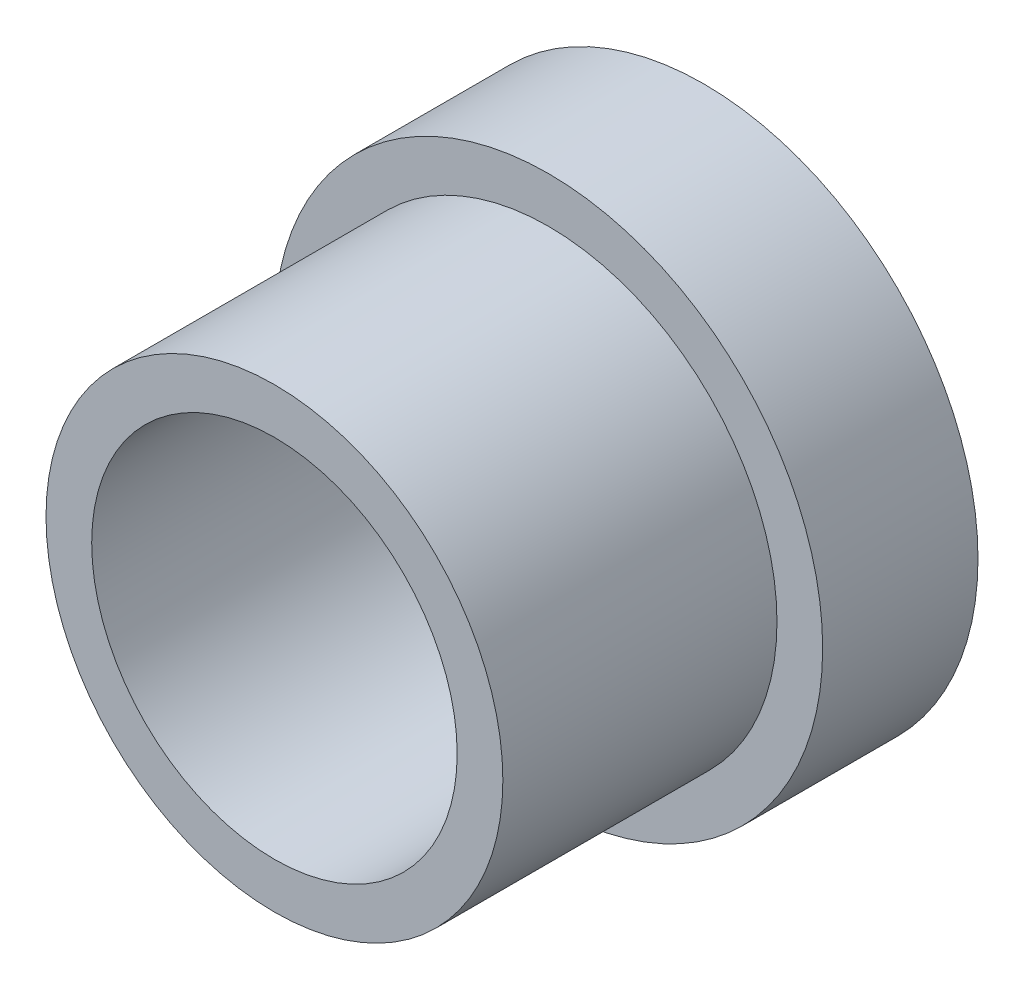
ISO-10303-21;
HEADER;
FILE_DESCRIPTION(('STEP AP214'),'2;1');
FILE_NAME('part.step','',(''),(''),'','','');
FILE_SCHEMA(('AUTOMOTIVE_DESIGN { 1 0 10303 214 1 1 1 1 }'));
ENDSEC;
DATA;
#1=APPLICATION_CONTEXT('core data for automotive mechanical design processes');
#2=APPLICATION_PROTOCOL_DEFINITION('international standard','automotive_design',2000,#1);
#3=PRODUCT_CONTEXT('',#1,'mechanical');
#4=PRODUCT('Part','Part','',(#3));
#5=PRODUCT_RELATED_PRODUCT_CATEGORY('part','',(#4));
#6=PRODUCT_DEFINITION_FORMATION('','',#4);
#7=PRODUCT_DEFINITION_CONTEXT('part definition',#1,'design');
#8=PRODUCT_DEFINITION('design','',#6,#7);
#9=PRODUCT_DEFINITION_SHAPE('','',#8);
#10=(LENGTH_UNIT() NAMED_UNIT(*) SI_UNIT(.MILLI.,.METRE.));
#11=(NAMED_UNIT(*) PLANE_ANGLE_UNIT() SI_UNIT($,.RADIAN.));
#12=(NAMED_UNIT(*) SI_UNIT($,.STERADIAN.) SOLID_ANGLE_UNIT());
#13=UNCERTAINTY_MEASURE_WITH_UNIT(LENGTH_MEASURE(1.E-05),#10,'distance_accuracy_value','');
#14=(GEOMETRIC_REPRESENTATION_CONTEXT(3) GLOBAL_UNCERTAINTY_ASSIGNED_CONTEXT((#13)) GLOBAL_UNIT_ASSIGNED_CONTEXT((#10,
#11,#12)) REPRESENTATION_CONTEXT('',''));
#15=CARTESIAN_POINT('',(0.,0.,0.));
#16=DIRECTION('',(0.,0.,1.));
#17=DIRECTION('',(1.,0.,0.));
#18=AXIS2_PLACEMENT_3D('',#15,#16,#17);
#19=CARTESIAN_POINT('',(0.,0.,1.7));
#20=DIRECTION('',(0.,0.,1.));
#21=DIRECTION('',(1.,0.,0.));
#22=AXIS2_PLACEMENT_3D('',#19,#20,#21);
#23=PLANE('',#22);
#24=CARTESIAN_POINT('',(0.,0.,1.7));
#25=DIRECTION('',(0.,0.,1.));
#26=DIRECTION('',(1.,0.,0.));
#27=AXIS2_PLACEMENT_3D('',#24,#25,#26);
#28=CIRCLE('',#27,3.);
#29=CARTESIAN_POINT('',(3.,0.,1.7));
#30=VERTEX_POINT('',#29);
#31=EDGE_CURVE('E10',#30,#30,#28,.T.);
#32=ORIENTED_EDGE('',*,*,#31,.T.);
#33=EDGE_LOOP('',(#32));
#34=FACE_BOUND('',#33,.T.);
#35=CARTESIAN_POINT('',(0.,0.,1.7));
#36=DIRECTION('',(0.,0.,1.));
#37=DIRECTION('',(1.,0.,0.));
#38=AXIS2_PLACEMENT_3D('',#35,#36,#37);
#39=CIRCLE('',#38,2.5);
#40=CARTESIAN_POINT('',(2.5,0.,1.7));
#41=VERTEX_POINT('',#40);
#42=EDGE_CURVE('E45',#41,#41,#39,.T.);
#43=ORIENTED_EDGE('',*,*,#42,.F.);
#44=EDGE_LOOP('',(#43));
#45=FACE_BOUND('',#44,.T.);
#46=ADVANCED_FACE('F29',(#34,#45),#23,.T.);
#47=CARTESIAN_POINT('',(0.,0.,0.));
#48=DIRECTION('',(0.,0.,1.));
#49=DIRECTION('',(1.,0.,0.));
#50=AXIS2_PLACEMENT_3D('',#47,#48,#49);
#51=PLANE('',#50);
#52=CARTESIAN_POINT('',(0.,0.,0.));
#53=DIRECTION('',(0.,0.,1.));
#54=DIRECTION('',(1.,0.,0.));
#55=AXIS2_PLACEMENT_3D('',#52,#53,#54);
#56=CIRCLE('',#55,3.);
#57=CARTESIAN_POINT('',(3.,0.,0.));
#58=VERTEX_POINT('',#57);
#59=EDGE_CURVE('E33',#58,#58,#56,.T.);
#60=ORIENTED_EDGE('',*,*,#59,.F.);
#61=EDGE_LOOP('',(#60));
#62=FACE_BOUND('',#61,.T.);
#63=CARTESIAN_POINT('',(0.,0.,0.));
#64=DIRECTION('',(0.,0.,1.));
#65=DIRECTION('',(1.,0.,0.));
#66=AXIS2_PLACEMENT_3D('',#63,#64,#65);
#67=CIRCLE('',#66,2.);
#68=CARTESIAN_POINT('',(2.,0.,0.));
#69=VERTEX_POINT('',#68);
#70=EDGE_CURVE('E40',#69,#69,#67,.T.);
#71=ORIENTED_EDGE('',*,*,#70,.T.);
#72=EDGE_LOOP('',(#71));
#73=FACE_BOUND('',#72,.T.);
#74=ADVANCED_FACE('F70',(#62,#73),#51,.F.);
#75=CARTESIAN_POINT('',(0.,0.,1.7));
#76=DIRECTION('',(0.,0.,-1.));
#77=DIRECTION('',(-1.,0.,0.));
#78=AXIS2_PLACEMENT_3D('',#75,#76,#77);
#79=CYLINDRICAL_SURFACE('',#78,3.);
#80=ORIENTED_EDGE('',*,*,#31,.F.);
#81=EDGE_LOOP('',(#80));
#82=FACE_BOUND('',#81,.T.);
#83=ORIENTED_EDGE('',*,*,#59,.T.);
#84=EDGE_LOOP('',(#83));
#85=FACE_BOUND('',#84,.T.);
#86=ADVANCED_FACE('F31',(#82,#85),#79,.T.);
#87=CARTESIAN_POINT('',(0.,0.,1.7));
#88=DIRECTION('',(0.,0.,-1.));
#89=DIRECTION('',(-1.,0.,0.));
#90=AXIS2_PLACEMENT_3D('',#87,#88,#89);
#91=CYLINDRICAL_SURFACE('',#90,2.);
#92=ORIENTED_EDGE('',*,*,#70,.F.);
#93=EDGE_LOOP('',(#92));
#94=FACE_BOUND('',#93,.T.);
#95=CARTESIAN_POINT('',(0.,0.,4.7));
#96=DIRECTION('',(0.,0.,1.));
#97=DIRECTION('',(1.,0.,0.));
#98=AXIS2_PLACEMENT_3D('',#95,#96,#97);
#99=CIRCLE('',#98,2.);
#100=CARTESIAN_POINT('',(2.,0.,4.7));
#101=VERTEX_POINT('',#100);
#102=EDGE_CURVE('E48',#101,#101,#99,.T.);
#103=ORIENTED_EDGE('',*,*,#102,.T.);
#104=EDGE_LOOP('',(#103));
#105=FACE_BOUND('',#104,.T.);
#106=ADVANCED_FACE('F54',(#94,#105),#91,.F.);
#107=CARTESIAN_POINT('',(0.,0.,4.7));
#108=DIRECTION('',(0.,0.,1.));
#109=DIRECTION('',(1.,0.,0.));
#110=AXIS2_PLACEMENT_3D('',#107,#108,#109);
#111=PLANE('',#110);
#112=CARTESIAN_POINT('',(0.,0.,4.7));
#113=DIRECTION('',(0.,0.,1.));
#114=DIRECTION('',(1.,0.,0.));
#115=AXIS2_PLACEMENT_3D('',#112,#113,#114);
#116=CIRCLE('',#115,2.5);
#117=CARTESIAN_POINT('',(2.5,0.,4.7));
#118=VERTEX_POINT('',#117);
#119=EDGE_CURVE('E44',#118,#118,#116,.T.);
#120=ORIENTED_EDGE('',*,*,#119,.T.);
#121=EDGE_LOOP('',(#120));
#122=FACE_BOUND('',#121,.T.);
#123=ORIENTED_EDGE('',*,*,#102,.F.);
#124=EDGE_LOOP('',(#123));
#125=FACE_BOUND('',#124,.T.);
#126=ADVANCED_FACE('F56',(#122,#125),#111,.T.);
#127=CARTESIAN_POINT('',(0.,0.,4.7));
#128=DIRECTION('',(0.,0.,-1.));
#129=DIRECTION('',(-1.,0.,0.));
#130=AXIS2_PLACEMENT_3D('',#127,#128,#129);
#131=CYLINDRICAL_SURFACE('',#130,2.5);
#132=ORIENTED_EDGE('',*,*,#119,.F.);
#133=EDGE_LOOP('',(#132));
#134=FACE_BOUND('',#133,.T.);
#135=ORIENTED_EDGE('',*,*,#42,.T.);
#136=EDGE_LOOP('',(#135));
#137=FACE_BOUND('',#136,.T.);
#138=ADVANCED_FACE('F58',(#134,#137),#131,.T.);
#139=CLOSED_SHELL('',(#46,#74,#86,#106,#126,#138));
#140=MANIFOLD_SOLID_BREP('B2',#139);
#141=ADVANCED_BREP_SHAPE_REPRESENTATION('',(#18,#140),#14);
#142=SHAPE_DEFINITION_REPRESENTATION(#9,#141);
ENDSEC;
END-ISO-10303-21;
